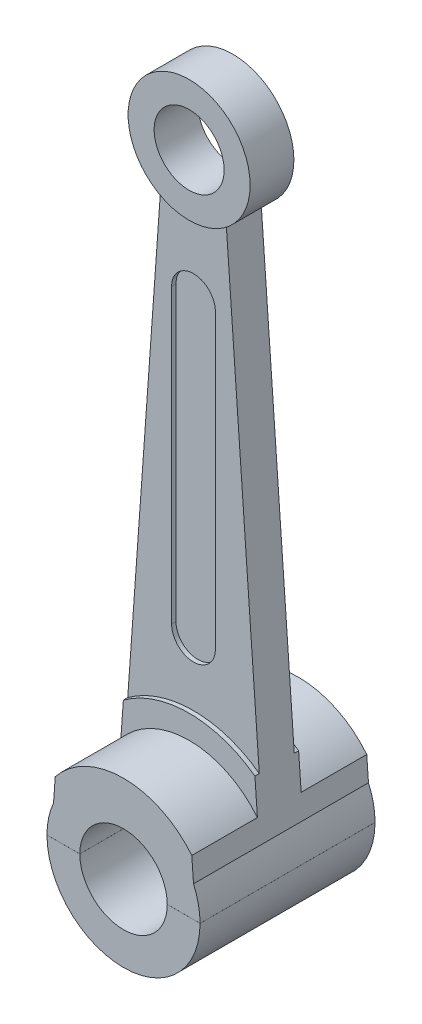
ISO-10303-21;
HEADER;
FILE_DESCRIPTION(('STEP AP214'),'2;1');
FILE_NAME('part.step','',(''),(''),'','','');
FILE_SCHEMA(('AUTOMOTIVE_DESIGN { 1 0 10303 214 1 1 1 1 }'));
ENDSEC;
DATA;
#1=APPLICATION_CONTEXT('core data for automotive mechanical design processes');
#2=APPLICATION_PROTOCOL_DEFINITION('international standard','automotive_design',2000,#1);
#3=PRODUCT_CONTEXT('',#1,'mechanical');
#4=PRODUCT('Part','Part','',(#3));
#5=PRODUCT_RELATED_PRODUCT_CATEGORY('part','',(#4));
#6=PRODUCT_DEFINITION_FORMATION('','',#4);
#7=PRODUCT_DEFINITION_CONTEXT('part definition',#1,'design');
#8=PRODUCT_DEFINITION('design','',#6,#7);
#9=PRODUCT_DEFINITION_SHAPE('','',#8);
#10=(LENGTH_UNIT() NAMED_UNIT(*) SI_UNIT(.MILLI.,.METRE.));
#11=(NAMED_UNIT(*) PLANE_ANGLE_UNIT() SI_UNIT($,.RADIAN.));
#12=(NAMED_UNIT(*) SI_UNIT($,.STERADIAN.) SOLID_ANGLE_UNIT());
#13=UNCERTAINTY_MEASURE_WITH_UNIT(LENGTH_MEASURE(1.E-05),#10,'distance_accuracy_value','');
#14=(GEOMETRIC_REPRESENTATION_CONTEXT(3) GLOBAL_UNCERTAINTY_ASSIGNED_CONTEXT((#13)) GLOBAL_UNIT_ASSIGNED_CONTEXT((#10,
#11,#12)) REPRESENTATION_CONTEXT('',''));
#15=CARTESIAN_POINT('',(0.,0.,0.));
#16=DIRECTION('',(0.,0.,1.));
#17=DIRECTION('',(1.,0.,0.));
#18=AXIS2_PLACEMENT_3D('',#15,#16,#17);
#19=CARTESIAN_POINT('',(0.,0.,-7.1));
#20=DIRECTION('',(0.,0.,1.));
#21=DIRECTION('',(1.,0.,0.));
#22=AXIS2_PLACEMENT_3D('',#19,#20,#21);
#23=CYLINDRICAL_SURFACE('',#22,1.75);
#24=CARTESIAN_POINT('',(0.,0.,-2.));
#25=DIRECTION('',(0.,0.,1.));
#26=DIRECTION('',(1.,0.,0.));
#27=AXIS2_PLACEMENT_3D('',#24,#25,#26);
#28=CIRCLE('',#27,1.75);
#29=CARTESIAN_POINT('',(-1.74999971428569,0.000999999999999184,-2.));
#30=VERTEX_POINT('',#29);
#31=CARTESIAN_POINT('',(-1.6,0.708872343937891,-2.));
#32=VERTEX_POINT('',#31);
#33=EDGE_CURVE('E305',#30,#32,#28,.F.);
#34=ORIENTED_EDGE('',*,*,#33,.F.);
#35=DIRECTION('',(0.,0.,1.));
#36=VECTOR('',#35,1.);
#37=CARTESIAN_POINT('',(-1.74999971428569,0.000999999999999184,-7.1));
#38=LINE('',#37,#36);
#39=CARTESIAN_POINT('',(-1.74999971428569,0.000999999999999185,2.));
#40=VERTEX_POINT('',#39);
#41=EDGE_CURVE('E352',#30,#40,#38,.T.);
#42=ORIENTED_EDGE('',*,*,#41,.T.);
#43=CARTESIAN_POINT('',(0.,0.,2.));
#44=DIRECTION('',(0.,0.,1.));
#45=DIRECTION('',(1.,0.,0.));
#46=AXIS2_PLACEMENT_3D('',#43,#44,#45);
#47=CIRCLE('',#46,1.75);
#48=CARTESIAN_POINT('',(-1.6,0.708872343937891,2.));
#49=VERTEX_POINT('',#48);
#50=EDGE_CURVE('E287',#40,#49,#47,.F.);
#51=ORIENTED_EDGE('',*,*,#50,.T.);
#52=DIRECTION('',(0.,0.,1.));
#53=VECTOR('',#52,1.);
#54=CARTESIAN_POINT('',(-1.6,0.708872343937891,-7.1));
#55=LINE('',#54,#53);
#56=EDGE_CURVE('E302',#32,#49,#55,.T.);
#57=ORIENTED_EDGE('',*,*,#56,.F.);
#58=EDGE_LOOP('',(#34,#42,#51,#57));
#59=FACE_BOUND('',#58,.T.);
#60=ADVANCED_FACE('F51',(#59),#23,.T.);
#61=CARTESIAN_POINT('',(0.,0.,0.5));
#62=DIRECTION('',(0.,0.,-1.));
#63=DIRECTION('',(-1.,0.,0.));
#64=AXIS2_PLACEMENT_3D('',#61,#62,#63);
#65=CYLINDRICAL_SURFACE('',#64,2.538);
#66=CARTESIAN_POINT('',(0.,0.,0.5));
#67=DIRECTION('',(0.,0.,1.));
#68=DIRECTION('',(1.,0.,0.));
#69=AXIS2_PLACEMENT_3D('',#66,#67,#68);
#70=CIRCLE('',#69,2.538);
#71=CARTESIAN_POINT('',(1.5038301502228,2.04448988241098,0.5));
#72=VERTEX_POINT('',#71);
#73=CARTESIAN_POINT('',(-1.5038301502228,2.04448988241098,0.5));
#74=VERTEX_POINT('',#73);
#75=EDGE_CURVE('E204',#72,#74,#70,.T.);
#76=ORIENTED_EDGE('',*,*,#75,.F.);
#77=DIRECTION('',(0.,0.,-1.));
#78=VECTOR('',#77,1.);
#79=CARTESIAN_POINT('',(1.5038301502228,2.04448988241098,0.5));
#80=LINE('',#79,#78);
#81=CARTESIAN_POINT('',(1.5038301502228,2.04448988241098,0.4));
#82=VERTEX_POINT('',#81);
#83=EDGE_CURVE('E283',#72,#82,#80,.T.);
#84=ORIENTED_EDGE('',*,*,#83,.T.);
#85=CARTESIAN_POINT('',(0.,0.,0.4));
#86=DIRECTION('',(0.,0.,1.));
#87=DIRECTION('',(1.,0.,0.));
#88=AXIS2_PLACEMENT_3D('',#85,#86,#87);
#89=CIRCLE('',#88,2.538);
#90=CARTESIAN_POINT('',(-1.5038301502228,2.04448988241098,0.4));
#91=VERTEX_POINT('',#90);
#92=EDGE_CURVE('E174',#82,#91,#89,.T.);
#93=ORIENTED_EDGE('',*,*,#92,.T.);
#94=DIRECTION('',(0.,0.,-1.));
#95=VECTOR('',#94,1.);
#96=CARTESIAN_POINT('',(-1.5038301502228,2.04448988241098,0.5));
#97=LINE('',#96,#95);
#98=EDGE_CURVE('E136',#91,#74,#97,.F.);
#99=ORIENTED_EDGE('',*,*,#98,.T.);
#100=EDGE_LOOP('',(#76,#84,#93,#99));
#101=FACE_BOUND('',#100,.T.);
#102=ADVANCED_FACE('F528',(#101),#65,.T.);
#103=CARTESIAN_POINT('',(0.,4.,0.4));
#104=DIRECTION('',(0.,0.,-1.));
#105=DIRECTION('',(-1.,0.,0.));
#106=AXIS2_PLACEMENT_3D('',#103,#104,#105);
#107=CYLINDRICAL_SURFACE('',#106,0.5);
#108=DIRECTION('',(0.,0.,-1.));
#109=VECTOR('',#108,1.);
#110=CARTESIAN_POINT('',(-0.499999999999999,4.,0.4));
#111=LINE('',#110,#109);
#112=CARTESIAN_POINT('',(-0.499999999999999,4.,-0.3));
#113=VERTEX_POINT('',#112);
#114=CARTESIAN_POINT('',(-0.499999999999999,4.,-0.4));
#115=VERTEX_POINT('',#114);
#116=EDGE_CURVE('E214',#113,#115,#111,.T.);
#117=ORIENTED_EDGE('',*,*,#116,.F.);
#118=CARTESIAN_POINT('',(0.,4.,-0.3));
#119=DIRECTION('',(0.,0.,1.));
#120=DIRECTION('',(1.,0.,0.));
#121=AXIS2_PLACEMENT_3D('',#118,#119,#120);
#122=CIRCLE('',#121,0.5);
#123=CARTESIAN_POINT('',(0.500000000000001,4.,-0.3));
#124=VERTEX_POINT('',#123);
#125=EDGE_CURVE('E221',#113,#124,#122,.T.);
#126=ORIENTED_EDGE('',*,*,#125,.T.);
#127=DIRECTION('',(0.,0.,-1.));
#128=VECTOR('',#127,1.);
#129=CARTESIAN_POINT('',(0.500000000000001,4.,0.4));
#130=LINE('',#129,#128);
#131=CARTESIAN_POINT('',(0.500000000000001,4.,-0.4));
#132=VERTEX_POINT('',#131);
#133=EDGE_CURVE('E225',#124,#132,#130,.T.);
#134=ORIENTED_EDGE('',*,*,#133,.T.);
#135=CARTESIAN_POINT('',(0.,4.,-0.4));
#136=DIRECTION('',(0.,0.,1.));
#137=DIRECTION('',(1.,0.,0.));
#138=AXIS2_PLACEMENT_3D('',#135,#136,#137);
#139=CIRCLE('',#138,0.5);
#140=EDGE_CURVE('E180',#115,#132,#139,.T.);
#141=ORIENTED_EDGE('',*,*,#140,.F.);
#142=EDGE_LOOP('',(#117,#126,#134,#141));
#143=FACE_BOUND('',#142,.T.);
#144=ADVANCED_FACE('F428',(#143),#107,.F.);
#145=CARTESIAN_POINT('',(-0.499999999999998,0.,0.4));
#146=DIRECTION('',(1.,0.,0.));
#147=DIRECTION('',(0.,1.,0.));
#148=AXIS2_PLACEMENT_3D('',#145,#146,#147);
#149=PLANE('',#148);
#150=DIRECTION('',(0.,0.,-1.));
#151=VECTOR('',#150,1.);
#152=CARTESIAN_POINT('',(-0.499999999999999,10.69,0.4));
#153=LINE('',#152,#151);
#154=CARTESIAN_POINT('',(-0.499999999999999,10.69,-0.3));
#155=VERTEX_POINT('',#154);
#156=CARTESIAN_POINT('',(-0.499999999999999,10.69,-0.4));
#157=VERTEX_POINT('',#156);
#158=EDGE_CURVE('E213',#155,#157,#153,.T.);
#159=ORIENTED_EDGE('',*,*,#158,.F.);
#160=DIRECTION('',(0.,-1.,0.));
#161=VECTOR('',#160,1.);
#162=CARTESIAN_POINT('',(-0.499999999999998,0.,-0.3));
#163=LINE('',#162,#161);
#164=EDGE_CURVE('E226',#155,#113,#163,.T.);
#165=ORIENTED_EDGE('',*,*,#164,.T.);
#166=ORIENTED_EDGE('',*,*,#116,.T.);
#167=DIRECTION('',(0.,-1.,0.));
#168=VECTOR('',#167,1.);
#169=CARTESIAN_POINT('',(-0.499999999999998,0.,-0.4));
#170=LINE('',#169,#168);
#171=EDGE_CURVE('E401',#157,#115,#170,.T.);
#172=ORIENTED_EDGE('',*,*,#171,.F.);
#173=EDGE_LOOP('',(#159,#165,#166,#172));
#174=FACE_BOUND('',#173,.T.);
#175=ADVANCED_FACE('F549',(#174),#149,.T.);
#176=CARTESIAN_POINT('',(0.,10.69,0.4));
#177=DIRECTION('',(0.,0.,-1.));
#178=DIRECTION('',(-1.,0.,0.));
#179=AXIS2_PLACEMENT_3D('',#176,#177,#178);
#180=CYLINDRICAL_SURFACE('',#179,0.5);
#181=DIRECTION('',(0.,0.,-1.));
#182=VECTOR('',#181,1.);
#183=CARTESIAN_POINT('',(0.5,10.69,0.4));
#184=LINE('',#183,#182);
#185=CARTESIAN_POINT('',(0.5,10.69,-0.3));
#186=VERTEX_POINT('',#185);
#187=CARTESIAN_POINT('',(0.5,10.69,-0.4));
#188=VERTEX_POINT('',#187);
#189=EDGE_CURVE('E392',#186,#188,#184,.T.);
#190=ORIENTED_EDGE('',*,*,#189,.F.);
#191=CARTESIAN_POINT('',(0.,10.69,-0.3));
#192=DIRECTION('',(0.,0.,1.));
#193=DIRECTION('',(1.,0.,0.));
#194=AXIS2_PLACEMENT_3D('',#191,#192,#193);
#195=CIRCLE('',#194,0.5);
#196=EDGE_CURVE('E209',#186,#155,#195,.T.);
#197=ORIENTED_EDGE('',*,*,#196,.T.);
#198=ORIENTED_EDGE('',*,*,#158,.T.);
#199=CARTESIAN_POINT('',(0.,10.69,-0.4));
#200=DIRECTION('',(0.,0.,1.));
#201=DIRECTION('',(1.,0.,0.));
#202=AXIS2_PLACEMENT_3D('',#199,#200,#201);
#203=CIRCLE('',#202,0.5);
#204=EDGE_CURVE('E405',#188,#157,#203,.T.);
#205=ORIENTED_EDGE('',*,*,#204,.F.);
#206=EDGE_LOOP('',(#190,#197,#198,#205));
#207=FACE_BOUND('',#206,.T.);
#208=ADVANCED_FACE('F543',(#207),#180,.F.);
#209=CARTESIAN_POINT('',(0.500000000000002,0.,0.4));
#210=DIRECTION('',(1.,0.,0.));
#211=DIRECTION('',(0.,1.,0.));
#212=AXIS2_PLACEMENT_3D('',#209,#210,#211);
#213=PLANE('',#212);
#214=DIRECTION('',(0.,-1.,0.));
#215=VECTOR('',#214,1.);
#216=CARTESIAN_POINT('',(0.500000000000002,0.,-0.3));
#217=LINE('',#216,#215);
#218=EDGE_CURVE('E215',#186,#124,#217,.T.);
#219=ORIENTED_EDGE('',*,*,#218,.F.);
#220=ORIENTED_EDGE('',*,*,#189,.T.);
#221=DIRECTION('',(0.,-1.,0.));
#222=VECTOR('',#221,1.);
#223=CARTESIAN_POINT('',(0.500000000000002,0.,-0.4));
#224=LINE('',#223,#222);
#225=EDGE_CURVE('E170',#188,#132,#224,.T.);
#226=ORIENTED_EDGE('',*,*,#225,.T.);
#227=ORIENTED_EDGE('',*,*,#133,.F.);
#228=EDGE_LOOP('',(#219,#220,#226,#227));
#229=FACE_BOUND('',#228,.T.);
#230=ADVANCED_FACE('F539',(#229),#213,.F.);
#231=CARTESIAN_POINT('',(0.,13.69,0.5));
#232=DIRECTION('',(0.,0.,-1.));
#233=DIRECTION('',(-1.,0.,0.));
#234=AXIS2_PLACEMENT_3D('',#231,#232,#233);
#235=CYLINDRICAL_SURFACE('',#234,0.8);
#236=CARTESIAN_POINT('',(0.,13.69,0.5));
#237=DIRECTION('',(0.,0.,1.));
#238=DIRECTION('',(1.,0.,0.));
#239=AXIS2_PLACEMENT_3D('',#236,#237,#238);
#240=CIRCLE('',#239,0.8);
#241=CARTESIAN_POINT('',(0.8,13.69,0.5));
#242=VERTEX_POINT('',#241);
#243=EDGE_CURVE('E163',#242,#242,#240,.T.);
#244=ORIENTED_EDGE('',*,*,#243,.T.);
#245=EDGE_LOOP('',(#244));
#246=FACE_BOUND('',#245,.T.);
#247=CARTESIAN_POINT('',(0.,13.69,-0.5));
#248=DIRECTION('',(0.,0.,1.));
#249=DIRECTION('',(1.,0.,0.));
#250=AXIS2_PLACEMENT_3D('',#247,#248,#249);
#251=CIRCLE('',#250,0.8);
#252=CARTESIAN_POINT('',(0.8,13.69,-0.5));
#253=VERTEX_POINT('',#252);
#254=EDGE_CURVE('E197',#253,#253,#251,.T.);
#255=ORIENTED_EDGE('',*,*,#254,.F.);
#256=EDGE_LOOP('',(#255));
#257=FACE_BOUND('',#256,.T.);
#258=ADVANCED_FACE('F752',(#246,#257),#235,.F.);
#259=CARTESIAN_POINT('',(0.,13.69,0.5));
#260=DIRECTION('',(0.,0.,-1.));
#261=DIRECTION('',(-1.,0.,0.));
#262=AXIS2_PLACEMENT_3D('',#259,#260,#261);
#263=CYLINDRICAL_SURFACE('',#262,1.395);
#264=CARTESIAN_POINT('',(0.,13.69,0.4));
#265=DIRECTION('',(0.,0.,1.));
#266=DIRECTION('',(1.,0.,0.));
#267=AXIS2_PLACEMENT_3D('',#264,#265,#266);
#268=CIRCLE('',#267,1.395);
#269=CARTESIAN_POINT('',(-0.75,12.5137666047931,0.399999999999998));
#270=VERTEX_POINT('',#269);
#271=CARTESIAN_POINT('',(0.75,12.5137666047931,0.399999999999998));
#272=VERTEX_POINT('',#271);
#273=EDGE_CURVE('E151',#270,#272,#268,.T.);
#274=ORIENTED_EDGE('',*,*,#273,.T.);
#275=DIRECTION('',(0.,0.,-1.));
#276=VECTOR('',#275,1.);
#277=CARTESIAN_POINT('',(0.75,12.5137666047931,0.4));
#278=LINE('',#277,#276);
#279=CARTESIAN_POINT('',(0.75,12.5137666047931,-0.400000000000002));
#280=VERTEX_POINT('',#279);
#281=EDGE_CURVE('E162',#272,#280,#278,.T.);
#282=ORIENTED_EDGE('',*,*,#281,.T.);
#283=CARTESIAN_POINT('',(0.,13.69,-0.4));
#284=DIRECTION('',(0.,0.,1.));
#285=DIRECTION('',(1.,0.,0.));
#286=AXIS2_PLACEMENT_3D('',#283,#284,#285);
#287=CIRCLE('',#286,1.395);
#288=CARTESIAN_POINT('',(-0.75,12.5137666047931,-0.400000000000002));
#289=VERTEX_POINT('',#288);
#290=EDGE_CURVE('E153',#289,#280,#287,.T.);
#291=ORIENTED_EDGE('',*,*,#290,.F.);
#292=DIRECTION('',(0.,0.,-1.));
#293=VECTOR('',#292,1.);
#294=CARTESIAN_POINT('',(-0.75,12.5137666047931,0.4));
#295=LINE('',#294,#293);
#296=EDGE_CURVE('E134',#270,#289,#295,.T.);
#297=ORIENTED_EDGE('',*,*,#296,.F.);
#298=EDGE_LOOP('',(#274,#282,#291,#297));
#299=FACE_BOUND('',#298,.T.);
#300=CARTESIAN_POINT('',(0.,13.69,-0.5));
#301=DIRECTION('',(0.,0.,1.));
#302=DIRECTION('',(1.,0.,0.));
#303=AXIS2_PLACEMENT_3D('',#300,#301,#302);
#304=CIRCLE('',#303,1.395);
#305=CARTESIAN_POINT('',(1.395,13.69,-0.5));
#306=VERTEX_POINT('',#305);
#307=EDGE_CURVE('E167',#306,#306,#304,.T.);
#308=ORIENTED_EDGE('',*,*,#307,.T.);
#309=EDGE_LOOP('',(#308));
#310=FACE_BOUND('',#309,.T.);
#311=CARTESIAN_POINT('',(0.,13.69,0.5));
#312=DIRECTION('',(0.,0.,1.));
#313=DIRECTION('',(1.,0.,0.));
#314=AXIS2_PLACEMENT_3D('',#311,#312,#313);
#315=CIRCLE('',#314,1.395);
#316=CARTESIAN_POINT('',(1.395,13.69,0.5));
#317=VERTEX_POINT('',#316);
#318=EDGE_CURVE('E376',#317,#317,#315,.T.);
#319=ORIENTED_EDGE('',*,*,#318,.F.);
#320=EDGE_LOOP('',(#319));
#321=FACE_BOUND('',#320,.T.);
#322=ADVANCED_FACE('F147',(#299,#310,#321),#263,.T.);
#323=CARTESIAN_POINT('',(0.,0.,0.5));
#324=DIRECTION('',(0.,0.,1.));
#325=DIRECTION('',(1.,0.,0.));
#326=AXIS2_PLACEMENT_3D('',#323,#324,#325);
#327=PLANE('',#326);
#328=ORIENTED_EDGE('',*,*,#243,.F.);
#329=EDGE_LOOP('',(#328));
#330=FACE_BOUND('',#329,.T.);
#331=ORIENTED_EDGE('',*,*,#318,.T.);
#332=EDGE_LOOP('',(#331));
#333=FACE_BOUND('',#332,.T.);
#334=ADVANCED_FACE('F733',(#330,#333),#327,.T.);
#335=CARTESIAN_POINT('',(0.,0.,-0.5));
#336=DIRECTION('',(0.,0.,1.));
#337=DIRECTION('',(1.,0.,0.));
#338=AXIS2_PLACEMENT_3D('',#335,#336,#337);
#339=PLANE('',#338);
#340=ORIENTED_EDGE('',*,*,#254,.T.);
#341=EDGE_LOOP('',(#340));
#342=FACE_BOUND('',#341,.T.);
#343=ORIENTED_EDGE('',*,*,#307,.F.);
#344=EDGE_LOOP('',(#343));
#345=FACE_BOUND('',#344,.T.);
#346=ADVANCED_FACE('F724',(#342,#345),#339,.F.);
#347=CARTESIAN_POINT('',(0.,4.,0.3));
#348=DIRECTION('',(0.,0.,1.));
#349=DIRECTION('',(1.,0.,0.));
#350=AXIS2_PLACEMENT_3D('',#347,#348,#349);
#351=CIRCLE('',#350,0.5);
#352=CARTESIAN_POINT('',(-0.499999999999999,4.,0.3));
#353=VERTEX_POINT('',#352);
#354=CARTESIAN_POINT('',(0.500000000000001,4.,0.3));
#355=VERTEX_POINT('',#354);
#356=EDGE_CURVE('E235',#353,#355,#351,.T.);
#357=ORIENTED_EDGE('',*,*,#356,.F.);
#358=CARTESIAN_POINT('',(-0.499999999999999,4.,0.4));
#359=VERTEX_POINT('',#358);
#360=EDGE_CURVE('E187',#359,#353,#111,.T.);
#361=ORIENTED_EDGE('',*,*,#360,.F.);
#362=CARTESIAN_POINT('',(0.,4.,0.4));
#363=DIRECTION('',(0.,0.,1.));
#364=DIRECTION('',(1.,0.,0.));
#365=AXIS2_PLACEMENT_3D('',#362,#363,#364);
#366=CIRCLE('',#365,0.5);
#367=CARTESIAN_POINT('',(0.500000000000001,4.,0.4));
#368=VERTEX_POINT('',#367);
#369=EDGE_CURVE('E193',#359,#368,#366,.T.);
#370=ORIENTED_EDGE('',*,*,#369,.T.);
#371=EDGE_CURVE('E192',#368,#355,#130,.T.);
#372=ORIENTED_EDGE('',*,*,#371,.T.);
#373=EDGE_LOOP('',(#357,#361,#370,#372));
#374=FACE_BOUND('',#373,.T.);
#375=ADVANCED_FACE('F560',(#374),#107,.F.);
#376=DIRECTION('',(0.,-1.,0.));
#377=VECTOR('',#376,1.);
#378=CARTESIAN_POINT('',(-0.499999999999998,0.,0.3));
#379=LINE('',#378,#377);
#380=CARTESIAN_POINT('',(-0.499999999999999,10.69,0.3));
#381=VERTEX_POINT('',#380);
#382=EDGE_CURVE('E219',#381,#353,#379,.T.);
#383=ORIENTED_EDGE('',*,*,#382,.F.);
#384=CARTESIAN_POINT('',(-0.499999999999999,10.69,0.4));
#385=VERTEX_POINT('',#384);
#386=EDGE_CURVE('E186',#385,#381,#153,.T.);
#387=ORIENTED_EDGE('',*,*,#386,.F.);
#388=DIRECTION('',(0.,-1.,0.));
#389=VECTOR('',#388,1.);
#390=CARTESIAN_POINT('',(-0.499999999999998,0.,0.4));
#391=LINE('',#390,#389);
#392=EDGE_CURVE('E188',#385,#359,#391,.T.);
#393=ORIENTED_EDGE('',*,*,#392,.T.);
#394=ORIENTED_EDGE('',*,*,#360,.T.);
#395=EDGE_LOOP('',(#383,#387,#393,#394));
#396=FACE_BOUND('',#395,.T.);
#397=ADVANCED_FACE('F552',(#396),#149,.T.);
#398=CARTESIAN_POINT('',(0.,10.69,0.3));
#399=DIRECTION('',(0.,0.,1.));
#400=DIRECTION('',(1.,0.,0.));
#401=AXIS2_PLACEMENT_3D('',#398,#399,#400);
#402=CIRCLE('',#401,0.5);
#403=CARTESIAN_POINT('',(0.5,10.69,0.3));
#404=VERTEX_POINT('',#403);
#405=EDGE_CURVE('E230',#404,#381,#402,.T.);
#406=ORIENTED_EDGE('',*,*,#405,.F.);
#407=CARTESIAN_POINT('',(0.5,10.69,0.4));
#408=VERTEX_POINT('',#407);
#409=EDGE_CURVE('E239',#408,#404,#184,.T.);
#410=ORIENTED_EDGE('',*,*,#409,.F.);
#411=CARTESIAN_POINT('',(0.,10.69,0.4));
#412=DIRECTION('',(0.,0.,1.));
#413=DIRECTION('',(1.,0.,0.));
#414=AXIS2_PLACEMENT_3D('',#411,#412,#413);
#415=CIRCLE('',#414,0.5);
#416=EDGE_CURVE('E182',#408,#385,#415,.T.);
#417=ORIENTED_EDGE('',*,*,#416,.T.);
#418=ORIENTED_EDGE('',*,*,#386,.T.);
#419=EDGE_LOOP('',(#406,#410,#417,#418));
#420=FACE_BOUND('',#419,.T.);
#421=ADVANCED_FACE('F558',(#420),#180,.F.);
#422=ORIENTED_EDGE('',*,*,#409,.T.);
#423=DIRECTION('',(0.,-1.,0.));
#424=VECTOR('',#423,1.);
#425=CARTESIAN_POINT('',(0.500000000000002,0.,0.3));
#426=LINE('',#425,#424);
#427=EDGE_CURVE('E181',#404,#355,#426,.T.);
#428=ORIENTED_EDGE('',*,*,#427,.T.);
#429=ORIENTED_EDGE('',*,*,#371,.F.);
#430=DIRECTION('',(0.,-1.,0.));
#431=VECTOR('',#430,1.);
#432=CARTESIAN_POINT('',(0.500000000000002,0.,0.4));
#433=LINE('',#432,#431);
#434=EDGE_CURVE('E176',#408,#368,#433,.T.);
#435=ORIENTED_EDGE('',*,*,#434,.F.);
#436=EDGE_LOOP('',(#422,#428,#429,#435));
#437=FACE_BOUND('',#436,.T.);
#438=ADVANCED_FACE('F692',(#437),#213,.F.);
#439=CARTESIAN_POINT('',(0.,0.,0.4));
#440=DIRECTION('',(0.,0.,1.));
#441=DIRECTION('',(1.,0.,0.));
#442=AXIS2_PLACEMENT_3D('',#439,#440,#441);
#443=PLANE('',#442);
#444=DIRECTION('',(0.0718181006562886,-0.997417746191697,0.));
#445=VECTOR('',#444,1.);
#446=CARTESIAN_POINT('',(1.64252585982471,0.118268486781843,0.4));
#447=LINE('',#446,#445);
#448=EDGE_CURVE('E160',#272,#82,#447,.T.);
#449=ORIENTED_EDGE('',*,*,#448,.F.);
#450=ORIENTED_EDGE('',*,*,#273,.F.);
#451=DIRECTION('',(0.0718181006562886,0.997417746191697,0.));
#452=VECTOR('',#451,1.);
#453=CARTESIAN_POINT('',(-1.64252585982471,0.118268486781843,0.4));
#454=LINE('',#453,#452);
#455=EDGE_CURVE('E131',#91,#270,#454,.T.);
#456=ORIENTED_EDGE('',*,*,#455,.F.);
#457=ORIENTED_EDGE('',*,*,#92,.F.);
#458=EDGE_LOOP('',(#449,#450,#456,#457));
#459=FACE_BOUND('',#458,.T.);
#460=ORIENTED_EDGE('',*,*,#369,.F.);
#461=ORIENTED_EDGE('',*,*,#392,.F.);
#462=ORIENTED_EDGE('',*,*,#416,.F.);
#463=ORIENTED_EDGE('',*,*,#434,.T.);
#464=EDGE_LOOP('',(#460,#461,#462,#463));
#465=FACE_BOUND('',#464,.T.);
#466=ADVANCED_FACE('F157',(#459,#465),#443,.T.);
#467=CARTESIAN_POINT('',(0.,0.,-0.4));
#468=DIRECTION('',(0.,0.,1.));
#469=DIRECTION('',(1.,0.,0.));
#470=AXIS2_PLACEMENT_3D('',#467,#468,#469);
#471=PLANE('',#470);
#472=ORIENTED_EDGE('',*,*,#140,.T.);
#473=ORIENTED_EDGE('',*,*,#225,.F.);
#474=ORIENTED_EDGE('',*,*,#204,.T.);
#475=ORIENTED_EDGE('',*,*,#171,.T.);
#476=EDGE_LOOP('',(#472,#473,#474,#475));
#477=FACE_BOUND('',#476,.T.);
#478=ORIENTED_EDGE('',*,*,#290,.T.);
#479=DIRECTION('',(0.0718181006562886,-0.997417746191697,0.));
#480=VECTOR('',#479,1.);
#481=CARTESIAN_POINT('',(1.64252585982471,0.118268486781843,-0.4));
#482=LINE('',#481,#480);
#483=CARTESIAN_POINT('',(1.5038301502228,2.04448988241098,-0.4));
#484=VERTEX_POINT('',#483);
#485=EDGE_CURVE('E259',#280,#484,#482,.T.);
#486=ORIENTED_EDGE('',*,*,#485,.T.);
#487=CARTESIAN_POINT('',(0.,0.,-0.4));
#488=DIRECTION('',(0.,0.,1.));
#489=DIRECTION('',(1.,0.,0.));
#490=AXIS2_PLACEMENT_3D('',#487,#488,#489);
#491=CIRCLE('',#490,2.538);
#492=CARTESIAN_POINT('',(-1.5038301502228,2.04448988241098,-0.4));
#493=VERTEX_POINT('',#492);
#494=EDGE_CURVE('E263',#484,#493,#491,.T.);
#495=ORIENTED_EDGE('',*,*,#494,.T.);
#496=DIRECTION('',(0.0718181006562886,0.997417746191697,0.));
#497=VECTOR('',#496,1.);
#498=CARTESIAN_POINT('',(-1.64252585982471,0.118268486781843,-0.4));
#499=LINE('',#498,#497);
#500=EDGE_CURVE('E102',#493,#289,#499,.T.);
#501=ORIENTED_EDGE('',*,*,#500,.T.);
#502=EDGE_LOOP('',(#478,#486,#495,#501));
#503=FACE_BOUND('',#502,.T.);
#504=ADVANCED_FACE('F417',(#477,#503),#471,.F.);
#505=ORIENTED_EDGE('',*,*,#494,.F.);
#506=CARTESIAN_POINT('',(1.5038301502228,2.04448988241098,-0.5));
#507=VERTEX_POINT('',#506);
#508=EDGE_CURVE('E203',#484,#507,#80,.T.);
#509=ORIENTED_EDGE('',*,*,#508,.T.);
#510=CARTESIAN_POINT('',(0.,0.,-0.5));
#511=DIRECTION('',(0.,0.,1.));
#512=DIRECTION('',(1.,0.,0.));
#513=AXIS2_PLACEMENT_3D('',#510,#511,#512);
#514=CIRCLE('',#513,2.538);
#515=CARTESIAN_POINT('',(-1.5038301502228,2.04448988241098,-0.5));
#516=VERTEX_POINT('',#515);
#517=EDGE_CURVE('E198',#507,#516,#514,.T.);
#518=ORIENTED_EDGE('',*,*,#517,.T.);
#519=EDGE_CURVE('E202',#516,#493,#97,.F.);
#520=ORIENTED_EDGE('',*,*,#519,.T.);
#521=EDGE_LOOP('',(#505,#509,#518,#520));
#522=FACE_BOUND('',#521,.T.);
#523=ADVANCED_FACE('F493',(#522),#65,.T.);
#524=CARTESIAN_POINT('',(0.,0.,0.5));
#525=DIRECTION('',(0.,0.,1.));
#526=DIRECTION('',(1.,0.,0.));
#527=AXIS2_PLACEMENT_3D('',#524,#525,#526);
#528=PLANE('',#527);
#529=DIRECTION('',(0.0718181006562886,-0.997417746191697,0.));
#530=VECTOR('',#529,1.);
#531=CARTESIAN_POINT('',(1.64252585982471,0.118268486781843,0.5));
#532=LINE('',#531,#530);
#533=CARTESIAN_POINT('',(1.56101559444764,1.25029209142955,0.5));
#534=VERTEX_POINT('',#533);
#535=EDGE_CURVE('E281',#72,#534,#532,.T.);
#536=ORIENTED_EDGE('',*,*,#535,.F.);
#537=ORIENTED_EDGE('',*,*,#75,.T.);
#538=DIRECTION('',(0.0718181006562886,0.997417746191697,0.));
#539=VECTOR('',#538,1.);
#540=CARTESIAN_POINT('',(-1.64252585982471,0.118268486781843,0.5));
#541=LINE('',#540,#539);
#542=CARTESIAN_POINT('',(-1.56101559444764,1.25029209142955,0.5));
#543=VERTEX_POINT('',#542);
#544=EDGE_CURVE('E142',#543,#74,#541,.T.);
#545=ORIENTED_EDGE('',*,*,#544,.F.);
#546=CARTESIAN_POINT('',(0.,0.,0.5));
#547=DIRECTION('',(0.,0.,1.));
#548=DIRECTION('',(1.,0.,0.));
#549=AXIS2_PLACEMENT_3D('',#546,#547,#548);
#550=CIRCLE('',#549,2.);
#551=EDGE_CURVE('E246',#534,#543,#550,.T.);
#552=ORIENTED_EDGE('',*,*,#551,.F.);
#553=EDGE_LOOP('',(#536,#537,#545,#552));
#554=FACE_BOUND('',#553,.T.);
#555=ADVANCED_FACE('F525',(#554),#528,.T.);
#556=CARTESIAN_POINT('',(0.,0.,-0.5));
#557=DIRECTION('',(0.,0.,1.));
#558=DIRECTION('',(1.,0.,0.));
#559=AXIS2_PLACEMENT_3D('',#556,#557,#558);
#560=PLANE('',#559);
#561=ORIENTED_EDGE('',*,*,#517,.F.);
#562=DIRECTION('',(0.0718181006562886,-0.997417746191697,0.));
#563=VECTOR('',#562,1.);
#564=CARTESIAN_POINT('',(1.64252585982471,0.118268486781843,-0.5));
#565=LINE('',#564,#563);
#566=CARTESIAN_POINT('',(1.56101559444764,1.25029209142955,-0.5));
#567=VERTEX_POINT('',#566);
#568=EDGE_CURVE('E208',#507,#567,#565,.T.);
#569=ORIENTED_EDGE('',*,*,#568,.T.);
#570=CARTESIAN_POINT('',(0.,0.,-0.5));
#571=DIRECTION('',(0.,0.,1.));
#572=DIRECTION('',(1.,0.,0.));
#573=AXIS2_PLACEMENT_3D('',#570,#571,#572);
#574=CIRCLE('',#573,2.);
#575=CARTESIAN_POINT('',(-1.56101559444764,1.25029209142955,-0.5));
#576=VERTEX_POINT('',#575);
#577=EDGE_CURVE('E267',#567,#576,#574,.T.);
#578=ORIENTED_EDGE('',*,*,#577,.T.);
#579=DIRECTION('',(0.0718181006562886,0.997417746191697,0.));
#580=VECTOR('',#579,1.);
#581=CARTESIAN_POINT('',(-1.64252585982471,0.118268486781843,-0.5));
#582=LINE('',#581,#580);
#583=EDGE_CURVE('E220',#576,#516,#582,.T.);
#584=ORIENTED_EDGE('',*,*,#583,.T.);
#585=EDGE_LOOP('',(#561,#569,#578,#584));
#586=FACE_BOUND('',#585,.T.);
#587=ADVANCED_FACE('F510',(#586),#560,.F.);
#588=CARTESIAN_POINT('',(0.,0.,-0.3));
#589=DIRECTION('',(0.,0.,1.));
#590=DIRECTION('',(1.,0.,0.));
#591=AXIS2_PLACEMENT_3D('',#588,#589,#590);
#592=PLANE('',#591);
#593=ORIENTED_EDGE('',*,*,#164,.F.);
#594=ORIENTED_EDGE('',*,*,#196,.F.);
#595=ORIENTED_EDGE('',*,*,#218,.T.);
#596=ORIENTED_EDGE('',*,*,#125,.F.);
#597=EDGE_LOOP('',(#593,#594,#595,#596));
#598=FACE_BOUND('',#597,.T.);
#599=ADVANCED_FACE('F548',(#598),#592,.F.);
#600=CARTESIAN_POINT('',(0.,0.,0.3));
#601=DIRECTION('',(0.,0.,1.));
#602=DIRECTION('',(1.,0.,0.));
#603=AXIS2_PLACEMENT_3D('',#600,#601,#602);
#604=PLANE('',#603);
#605=ORIENTED_EDGE('',*,*,#382,.T.);
#606=ORIENTED_EDGE('',*,*,#356,.T.);
#607=ORIENTED_EDGE('',*,*,#427,.F.);
#608=ORIENTED_EDGE('',*,*,#405,.T.);
#609=EDGE_LOOP('',(#605,#606,#607,#608));
#610=FACE_BOUND('',#609,.T.);
#611=ADVANCED_FACE('F588',(#610),#604,.T.);
#612=CARTESIAN_POINT('',(0.,0.,-2.));
#613=DIRECTION('',(0.,0.,1.));
#614=DIRECTION('',(1.,0.,0.));
#615=AXIS2_PLACEMENT_3D('',#612,#613,#614);
#616=CYLINDRICAL_SURFACE('',#615,2.);
#617=DIRECTION('',(0.,0.,1.));
#618=VECTOR('',#617,1.);
#619=CARTESIAN_POINT('',(1.56101559444764,1.25029209142955,-2.));
#620=LINE('',#619,#618);
#621=CARTESIAN_POINT('',(1.56101559444764,1.25029209142955,-2.));
#622=VERTEX_POINT('',#621);
#623=EDGE_CURVE('E268',#622,#567,#620,.T.);
#624=ORIENTED_EDGE('',*,*,#623,.F.);
#625=CARTESIAN_POINT('',(0.,0.,-2.));
#626=DIRECTION('',(0.,0.,1.));
#627=DIRECTION('',(1.,0.,0.));
#628=AXIS2_PLACEMENT_3D('',#625,#626,#627);
#629=CIRCLE('',#628,2.);
#630=CARTESIAN_POINT('',(-1.56101559444764,1.25029209142955,-2.));
#631=VERTEX_POINT('',#630);
#632=EDGE_CURVE('E234',#622,#631,#629,.T.);
#633=ORIENTED_EDGE('',*,*,#632,.T.);
#634=DIRECTION('',(0.,0.,1.));
#635=VECTOR('',#634,1.);
#636=CARTESIAN_POINT('',(-1.56101559444764,1.25029209142955,-2.));
#637=LINE('',#636,#635);
#638=EDGE_CURVE('E272',#576,#631,#637,.F.);
#639=ORIENTED_EDGE('',*,*,#638,.F.);
#640=ORIENTED_EDGE('',*,*,#577,.F.);
#641=EDGE_LOOP('',(#624,#633,#639,#640));
#642=FACE_BOUND('',#641,.T.);
#643=ADVANCED_FACE('F508',(#642),#616,.T.);
#644=CARTESIAN_POINT('',(0.,0.,-2.));
#645=DIRECTION('',(0.,0.,1.));
#646=DIRECTION('',(1.,0.,0.));
#647=AXIS2_PLACEMENT_3D('',#644,#645,#646);
#648=PLANE('',#647);
#649=CARTESIAN_POINT('',(1.6,0.708872343937891,-2.));
#650=VERTEX_POINT('',#649);
#651=CARTESIAN_POINT('',(1.74999971428569,0.000999999999999606,-2.));
#652=VERTEX_POINT('',#651);
#653=EDGE_CURVE('E55',#650,#652,#28,.F.);
#654=ORIENTED_EDGE('',*,*,#653,.T.);
#655=DIRECTION('',(-1.,0.,0.));
#656=VECTOR('',#655,1.);
#657=CARTESIAN_POINT('',(0.,0.000999999999999395,-2.));
#658=LINE('',#657,#656);
#659=CARTESIAN_POINT('',(0.999999499999875,0.000999999999999516,-2.));
#660=VERTEX_POINT('',#659);
#661=EDGE_CURVE('E324',#652,#660,#658,.T.);
#662=ORIENTED_EDGE('',*,*,#661,.T.);
#663=CARTESIAN_POINT('',(0.,0.,-2.));
#664=DIRECTION('',(0.,0.,1.));
#665=DIRECTION('',(1.,0.,0.));
#666=AXIS2_PLACEMENT_3D('',#663,#664,#665);
#667=CIRCLE('',#666,1.);
#668=CARTESIAN_POINT('',(-0.999999499999875,0.000999999999999275,-2.));
#669=VERTEX_POINT('',#668);
#670=EDGE_CURVE('E328',#660,#669,#667,.T.);
#671=ORIENTED_EDGE('',*,*,#670,.T.);
#672=EDGE_CURVE('E72',#669,#30,#658,.T.);
#673=ORIENTED_EDGE('',*,*,#672,.T.);
#674=ORIENTED_EDGE('',*,*,#33,.T.);
#675=DIRECTION('',(0.0718181006562886,0.997417746191697,0.));
#676=VECTOR('',#675,1.);
#677=CARTESIAN_POINT('',(-1.64252585982471,0.118268486781843,-2.));
#678=LINE('',#677,#676);
#679=EDGE_CURVE('E278',#32,#631,#678,.T.);
#680=ORIENTED_EDGE('',*,*,#679,.T.);
#681=ORIENTED_EDGE('',*,*,#632,.F.);
#682=DIRECTION('',(0.0718181006562886,-0.997417746191697,0.));
#683=VECTOR('',#682,1.);
#684=CARTESIAN_POINT('',(1.64252585982471,0.118268486781843,-2.));
#685=LINE('',#684,#683);
#686=EDGE_CURVE('E274',#622,#650,#685,.T.);
#687=ORIENTED_EDGE('',*,*,#686,.T.);
#688=EDGE_LOOP('',(#654,#662,#671,#673,#674,#680,#681,#687));
#689=FACE_BOUND('',#688,.T.);
#690=ADVANCED_FACE('F53',(#689),#648,.F.);
#691=CARTESIAN_POINT('',(0.,0.,0.5));
#692=DIRECTION('',(0.,0.,-1.));
#693=DIRECTION('',(-1.,0.,0.));
#694=AXIS2_PLACEMENT_3D('',#691,#692,#693);
#695=CYLINDRICAL_SURFACE('',#694,1.);
#696=DIRECTION('',(0.,0.,-1.));
#697=VECTOR('',#696,1.);
#698=CARTESIAN_POINT('',(0.999999499999875,0.000999999999999516,0.5));
#699=LINE('',#698,#697);
#700=CARTESIAN_POINT('',(0.999999499999875,0.000999999999999516,2.));
#701=VERTEX_POINT('',#700);
#702=EDGE_CURVE('E323',#701,#660,#699,.T.);
#703=ORIENTED_EDGE('',*,*,#702,.F.);
#704=CARTESIAN_POINT('',(0.,0.,2.));
#705=DIRECTION('',(0.,0.,1.));
#706=DIRECTION('',(1.,0.,0.));
#707=AXIS2_PLACEMENT_3D('',#704,#705,#706);
#708=CIRCLE('',#707,1.);
#709=CARTESIAN_POINT('',(-0.999999499999875,0.000999999999999275,2.));
#710=VERTEX_POINT('',#709);
#711=EDGE_CURVE('E251',#701,#710,#708,.T.);
#712=ORIENTED_EDGE('',*,*,#711,.T.);
#713=DIRECTION('',(0.,0.,-1.));
#714=VECTOR('',#713,1.);
#715=CARTESIAN_POINT('',(-0.999999499999875,0.000999999999999275,0.5));
#716=LINE('',#715,#714);
#717=EDGE_CURVE('E62',#669,#710,#716,.F.);
#718=ORIENTED_EDGE('',*,*,#717,.F.);
#719=ORIENTED_EDGE('',*,*,#670,.F.);
#720=EDGE_LOOP('',(#703,#712,#718,#719));
#721=FACE_BOUND('',#720,.T.);
#722=ADVANCED_FACE('F341',(#721),#695,.F.);
#723=DIRECTION('',(0.,0.,1.));
#724=VECTOR('',#723,1.);
#725=CARTESIAN_POINT('',(1.56101559444764,1.25029209142955,-2.));
#726=LINE('',#725,#724);
#727=CARTESIAN_POINT('',(1.56101559444764,1.25029209142955,2.));
#728=VERTEX_POINT('',#727);
#729=EDGE_CURVE('E291',#534,#728,#726,.T.);
#730=ORIENTED_EDGE('',*,*,#729,.F.);
#731=ORIENTED_EDGE('',*,*,#551,.T.);
#732=DIRECTION('',(0.,0.,1.));
#733=VECTOR('',#732,1.);
#734=CARTESIAN_POINT('',(-1.56101559444764,1.25029209142955,-2.));
#735=LINE('',#734,#733);
#736=CARTESIAN_POINT('',(-1.56101559444764,1.25029209142955,2.));
#737=VERTEX_POINT('',#736);
#738=EDGE_CURVE('E311',#737,#543,#735,.F.);
#739=ORIENTED_EDGE('',*,*,#738,.F.);
#740=CARTESIAN_POINT('',(0.,0.,2.));
#741=DIRECTION('',(0.,0.,1.));
#742=DIRECTION('',(1.,0.,0.));
#743=AXIS2_PLACEMENT_3D('',#740,#741,#742);
#744=CIRCLE('',#743,2.);
#745=EDGE_CURVE('E250',#728,#737,#744,.T.);
#746=ORIENTED_EDGE('',*,*,#745,.F.);
#747=EDGE_LOOP('',(#730,#731,#739,#746));
#748=FACE_BOUND('',#747,.T.);
#749=ADVANCED_FACE('F520',(#748),#616,.T.);
#750=CARTESIAN_POINT('',(0.,0.,2.));
#751=DIRECTION('',(0.,0.,1.));
#752=DIRECTION('',(1.,0.,0.));
#753=AXIS2_PLACEMENT_3D('',#750,#751,#752);
#754=PLANE('',#753);
#755=DIRECTION('',(-1.,0.,0.));
#756=VECTOR('',#755,1.);
#757=CARTESIAN_POINT('',(0.,0.000999999999999395,2.));
#758=LINE('',#757,#756);
#759=CARTESIAN_POINT('',(1.74999971428569,0.000999999999999606,2.));
#760=VERTEX_POINT('',#759);
#761=EDGE_CURVE('E64',#760,#701,#758,.T.);
#762=ORIENTED_EDGE('',*,*,#761,.F.);
#763=CARTESIAN_POINT('',(1.6,0.708872343937891,2.));
#764=VERTEX_POINT('',#763);
#765=EDGE_CURVE('E258',#764,#760,#47,.F.);
#766=ORIENTED_EDGE('',*,*,#765,.F.);
#767=DIRECTION('',(0.0718181006562886,-0.997417746191697,0.));
#768=VECTOR('',#767,1.);
#769=CARTESIAN_POINT('',(1.64252585982471,0.118268486781843,2.));
#770=LINE('',#769,#768);
#771=EDGE_CURVE('E273',#728,#764,#770,.T.);
#772=ORIENTED_EDGE('',*,*,#771,.F.);
#773=ORIENTED_EDGE('',*,*,#745,.T.);
#774=DIRECTION('',(0.0718181006562886,0.997417746191697,0.));
#775=VECTOR('',#774,1.);
#776=CARTESIAN_POINT('',(-1.64252585982471,0.118268486781843,2.));
#777=LINE('',#776,#775);
#778=EDGE_CURVE('E314',#49,#737,#777,.T.);
#779=ORIENTED_EDGE('',*,*,#778,.F.);
#780=ORIENTED_EDGE('',*,*,#50,.F.);
#781=EDGE_CURVE('E12',#710,#40,#758,.T.);
#782=ORIENTED_EDGE('',*,*,#781,.F.);
#783=ORIENTED_EDGE('',*,*,#711,.F.);
#784=EDGE_LOOP('',(#762,#766,#772,#773,#779,#780,#782,#783));
#785=FACE_BOUND('',#784,.T.);
#786=ADVANCED_FACE('F345',(#785),#754,.T.);
#787=ORIENTED_EDGE('',*,*,#765,.T.);
#788=DIRECTION('',(0.,0.,1.));
#789=VECTOR('',#788,1.);
#790=CARTESIAN_POINT('',(1.74999971428569,0.000999999999999606,-7.1));
#791=LINE('',#790,#789);
#792=EDGE_CURVE('E94',#760,#652,#791,.F.);
#793=ORIENTED_EDGE('',*,*,#792,.T.);
#794=ORIENTED_EDGE('',*,*,#653,.F.);
#795=DIRECTION('',(0.,0.,1.));
#796=VECTOR('',#795,1.);
#797=CARTESIAN_POINT('',(1.6,0.708872343937891,-7.1));
#798=LINE('',#797,#796);
#799=EDGE_CURVE('E282',#650,#764,#798,.T.);
#800=ORIENTED_EDGE('',*,*,#799,.T.);
#801=EDGE_LOOP('',(#787,#793,#794,#800));
#802=FACE_BOUND('',#801,.T.);
#803=ADVANCED_FACE('F514',(#802),#23,.T.);
#804=CARTESIAN_POINT('',(0.75,12.5137666047931,-7.1));
#805=DIRECTION('',(-0.997417746191696,-0.0718181006562886,0.));
#806=DIRECTION('',(0.0718181006562886,-0.997417746191697,0.));
#807=AXIS2_PLACEMENT_3D('',#804,#805,#806);
#808=PLANE('',#807);
#809=ORIENTED_EDGE('',*,*,#281,.F.);
#810=ORIENTED_EDGE('',*,*,#448,.T.);
#811=ORIENTED_EDGE('',*,*,#83,.F.);
#812=ORIENTED_EDGE('',*,*,#535,.T.);
#813=ORIENTED_EDGE('',*,*,#729,.T.);
#814=ORIENTED_EDGE('',*,*,#771,.T.);
#815=ORIENTED_EDGE('',*,*,#799,.F.);
#816=ORIENTED_EDGE('',*,*,#686,.F.);
#817=ORIENTED_EDGE('',*,*,#623,.T.);
#818=ORIENTED_EDGE('',*,*,#568,.F.);
#819=ORIENTED_EDGE('',*,*,#508,.F.);
#820=ORIENTED_EDGE('',*,*,#485,.F.);
#821=EDGE_LOOP('',(#809,#810,#811,#812,#813,#814,#815,#816,#817,#818,#819,#820));
#822=FACE_BOUND('',#821,.T.);
#823=ADVANCED_FACE('F489',(#822),#808,.F.);
#824=CARTESIAN_POINT('',(-0.75,12.5137666047931,-7.1));
#825=DIRECTION('',(0.997417746191696,-0.0718181006562886,0.));
#826=DIRECTION('',(0.0718181006562886,0.997417746191697,0.));
#827=AXIS2_PLACEMENT_3D('',#824,#825,#826);
#828=PLANE('',#827);
#829=ORIENTED_EDGE('',*,*,#519,.F.);
#830=ORIENTED_EDGE('',*,*,#583,.F.);
#831=ORIENTED_EDGE('',*,*,#638,.T.);
#832=ORIENTED_EDGE('',*,*,#679,.F.);
#833=ORIENTED_EDGE('',*,*,#56,.T.);
#834=ORIENTED_EDGE('',*,*,#778,.T.);
#835=ORIENTED_EDGE('',*,*,#738,.T.);
#836=ORIENTED_EDGE('',*,*,#544,.T.);
#837=ORIENTED_EDGE('',*,*,#98,.F.);
#838=ORIENTED_EDGE('',*,*,#455,.T.);
#839=ORIENTED_EDGE('',*,*,#296,.T.);
#840=ORIENTED_EDGE('',*,*,#500,.F.);
#841=EDGE_LOOP('',(#829,#830,#831,#832,#833,#834,#835,#836,#837,#838,#839,#840));
#842=FACE_BOUND('',#841,.T.);
#843=ADVANCED_FACE('F133',(#842),#828,.F.);
#844=CARTESIAN_POINT('',(0.,0.000999999999999395,-10.91));
#845=DIRECTION('',(0.,1.,0.));
#846=DIRECTION('',(-1.,0.,0.));
#847=AXIS2_PLACEMENT_3D('',#844,#845,#846);
#848=PLANE('',#847);
#849=ORIENTED_EDGE('',*,*,#792,.F.);
#850=ORIENTED_EDGE('',*,*,#761,.T.);
#851=ORIENTED_EDGE('',*,*,#702,.T.);
#852=ORIENTED_EDGE('',*,*,#661,.F.);
#853=EDGE_LOOP('',(#849,#850,#851,#852));
#854=FACE_BOUND('',#853,.T.);
#855=ADVANCED_FACE('F597',(#854),#848,.F.);
#856=ORIENTED_EDGE('',*,*,#717,.T.);
#857=ORIENTED_EDGE('',*,*,#781,.T.);
#858=ORIENTED_EDGE('',*,*,#41,.F.);
#859=ORIENTED_EDGE('',*,*,#672,.F.);
#860=EDGE_LOOP('',(#856,#857,#858,#859));
#861=FACE_BOUND('',#860,.T.);
#862=ADVANCED_FACE('F351',(#861),#848,.F.);
#863=CLOSED_SHELL('',(#60,#102,#144,#175,#208,#230,#258,#322,#334,#346,#375,#397,#421,#438,#466,
#504,#523,#555,#587,#599,#611,#643,#690,#722,#749,#786,#803,#823,#843,#855,#862));
#864=MANIFOLD_SOLID_BREP('B2',#863);
#865=CARTESIAN_POINT('',(0.,0.,-7.1));
#866=DIRECTION('',(0.,0.,1.));
#867=DIRECTION('',(1.,0.,0.));
#868=AXIS2_PLACEMENT_3D('',#865,#866,#867);
#869=CYLINDRICAL_SURFACE('',#868,1.75);
#870=DIRECTION('',(0.,0.,1.));
#871=VECTOR('',#870,1.);
#872=CARTESIAN_POINT('',(-1.75,0.,-7.1));
#873=LINE('',#872,#871);
#874=CARTESIAN_POINT('',(-1.75,0.,-2.));
#875=VERTEX_POINT('',#874);
#876=CARTESIAN_POINT('',(-1.75,0.,2.));
#877=VERTEX_POINT('',#876);
#878=EDGE_CURVE('E49',#875,#877,#873,.T.);
#879=ORIENTED_EDGE('',*,*,#878,.F.);
#880=CARTESIAN_POINT('',(0.,0.,-2.));
#881=DIRECTION('',(0.,0.,1.));
#882=DIRECTION('',(1.,0.,0.));
#883=AXIS2_PLACEMENT_3D('',#880,#881,#882);
#884=CIRCLE('',#883,1.75);
#885=CARTESIAN_POINT('',(1.75,0.,-2.));
#886=VERTEX_POINT('',#885);
#887=EDGE_CURVE('E879',#886,#875,#884,.F.);
#888=ORIENTED_EDGE('',*,*,#887,.F.);
#889=DIRECTION('',(0.,0.,1.));
#890=VECTOR('',#889,1.);
#891=CARTESIAN_POINT('',(1.75,0.,-7.1));
#892=LINE('',#891,#890);
#893=CARTESIAN_POINT('',(1.75,0.,2.));
#894=VERTEX_POINT('',#893);
#895=EDGE_CURVE('E837',#894,#886,#892,.F.);
#896=ORIENTED_EDGE('',*,*,#895,.F.);
#897=CARTESIAN_POINT('',(0.,0.,2.));
#898=DIRECTION('',(0.,0.,1.));
#899=DIRECTION('',(1.,0.,0.));
#900=AXIS2_PLACEMENT_3D('',#897,#898,#899);
#901=CIRCLE('',#900,1.75);
#902=EDGE_CURVE('E874',#894,#877,#901,.F.);
#903=ORIENTED_EDGE('',*,*,#902,.T.);
#904=EDGE_LOOP('',(#879,#888,#896,#903));
#905=FACE_BOUND('',#904,.T.);
#906=ADVANCED_FACE('F829',(#905),#869,.T.);
#907=CARTESIAN_POINT('',(0.,0.,2.));
#908=DIRECTION('',(0.,0.,1.));
#909=DIRECTION('',(1.,0.,0.));
#910=AXIS2_PLACEMENT_3D('',#907,#908,#909);
#911=PLANE('',#910);
#912=ORIENTED_EDGE('',*,*,#902,.F.);
#913=DIRECTION('',(-1.,0.,0.));
#914=VECTOR('',#913,1.);
#915=CARTESIAN_POINT('',(0.,0.,2.));
#916=LINE('',#915,#914);
#917=CARTESIAN_POINT('',(1.,0.,2.));
#918=VERTEX_POINT('',#917);
#919=EDGE_CURVE('E851',#894,#918,#916,.T.);
#920=ORIENTED_EDGE('',*,*,#919,.T.);
#921=CARTESIAN_POINT('',(0.,0.,2.));
#922=DIRECTION('',(0.,0.,1.));
#923=DIRECTION('',(1.,0.,0.));
#924=AXIS2_PLACEMENT_3D('',#921,#922,#923);
#925=CIRCLE('',#924,1.);
#926=CARTESIAN_POINT('',(-1.,0.,2.));
#927=VERTEX_POINT('',#926);
#928=EDGE_CURVE('E885',#927,#918,#925,.T.);
#929=ORIENTED_EDGE('',*,*,#928,.F.);
#930=EDGE_CURVE('E882',#927,#877,#916,.T.);
#931=ORIENTED_EDGE('',*,*,#930,.T.);
#932=EDGE_LOOP('',(#912,#920,#929,#931));
#933=FACE_BOUND('',#932,.T.);
#934=ADVANCED_FACE('F895',(#933),#911,.T.);
#935=CARTESIAN_POINT('',(0.,0.,0.5));
#936=DIRECTION('',(0.,0.,-1.));
#937=DIRECTION('',(-1.,0.,0.));
#938=AXIS2_PLACEMENT_3D('',#935,#936,#937);
#939=CYLINDRICAL_SURFACE('',#938,1.);
#940=ORIENTED_EDGE('',*,*,#928,.T.);
#941=DIRECTION('',(0.,0.,-1.));
#942=VECTOR('',#941,1.);
#943=CARTESIAN_POINT('',(1.,0.,0.5));
#944=LINE('',#943,#942);
#945=CARTESIAN_POINT('',(1.,0.,-2.));
#946=VERTEX_POINT('',#945);
#947=EDGE_CURVE('E883',#918,#946,#944,.T.);
#948=ORIENTED_EDGE('',*,*,#947,.T.);
#949=CARTESIAN_POINT('',(0.,0.,-2.));
#950=DIRECTION('',(0.,0.,1.));
#951=DIRECTION('',(1.,0.,0.));
#952=AXIS2_PLACEMENT_3D('',#949,#950,#951);
#953=CIRCLE('',#952,1.);
#954=CARTESIAN_POINT('',(-1.,0.,-2.));
#955=VERTEX_POINT('',#954);
#956=EDGE_CURVE('E881',#955,#946,#953,.T.);
#957=ORIENTED_EDGE('',*,*,#956,.F.);
#958=DIRECTION('',(0.,0.,-1.));
#959=VECTOR('',#958,1.);
#960=CARTESIAN_POINT('',(-1.,0.,0.5));
#961=LINE('',#960,#959);
#962=EDGE_CURVE('E889',#955,#927,#961,.F.);
#963=ORIENTED_EDGE('',*,*,#962,.T.);
#964=EDGE_LOOP('',(#940,#948,#957,#963));
#965=FACE_BOUND('',#964,.T.);
#966=ADVANCED_FACE('F831',(#965),#939,.F.);
#967=CARTESIAN_POINT('',(0.,0.,-2.));
#968=DIRECTION('',(0.,0.,1.));
#969=DIRECTION('',(1.,0.,0.));
#970=AXIS2_PLACEMENT_3D('',#967,#968,#969);
#971=PLANE('',#970);
#972=DIRECTION('',(-1.,0.,0.));
#973=VECTOR('',#972,1.);
#974=CARTESIAN_POINT('',(0.,0.,-2.));
#975=LINE('',#974,#973);
#976=EDGE_CURVE('E868',#886,#946,#975,.T.);
#977=ORIENTED_EDGE('',*,*,#976,.F.);
#978=ORIENTED_EDGE('',*,*,#887,.T.);
#979=EDGE_CURVE('E843',#955,#875,#975,.T.);
#980=ORIENTED_EDGE('',*,*,#979,.F.);
#981=ORIENTED_EDGE('',*,*,#956,.T.);
#982=EDGE_LOOP('',(#977,#978,#980,#981));
#983=FACE_BOUND('',#982,.T.);
#984=ADVANCED_FACE('F878',(#983),#971,.F.);
#985=CARTESIAN_POINT('',(0.,0.,-10.91));
#986=DIRECTION('',(0.,1.,0.));
#987=DIRECTION('',(0.,0.,1.));
#988=AXIS2_PLACEMENT_3D('',#985,#986,#987);
#989=PLANE('',#988);
#990=ORIENTED_EDGE('',*,*,#976,.T.);
#991=ORIENTED_EDGE('',*,*,#947,.F.);
#992=ORIENTED_EDGE('',*,*,#919,.F.);
#993=ORIENTED_EDGE('',*,*,#895,.T.);
#994=EDGE_LOOP('',(#990,#991,#992,#993));
#995=FACE_BOUND('',#994,.T.);
#996=ADVANCED_FACE('F867',(#995),#989,.T.);
#997=ORIENTED_EDGE('',*,*,#979,.T.);
#998=ORIENTED_EDGE('',*,*,#878,.T.);
#999=ORIENTED_EDGE('',*,*,#930,.F.);
#1000=ORIENTED_EDGE('',*,*,#962,.F.);
#1001=EDGE_LOOP('',(#997,#998,#999,#1000));
#1002=FACE_BOUND('',#1001,.T.);
#1003=ADVANCED_FACE('F901',(#1002),#989,.T.);
#1004=CLOSED_SHELL('',(#906,#934,#966,#984,#996,#1003));
#1005=MANIFOLD_SOLID_BREP('B6',#1004);
#1006=ADVANCED_BREP_SHAPE_REPRESENTATION('',(#18,#864,#1005),#14);
#1007=SHAPE_DEFINITION_REPRESENTATION(#9,#1006);
ENDSEC;
END-ISO-10303-21;
